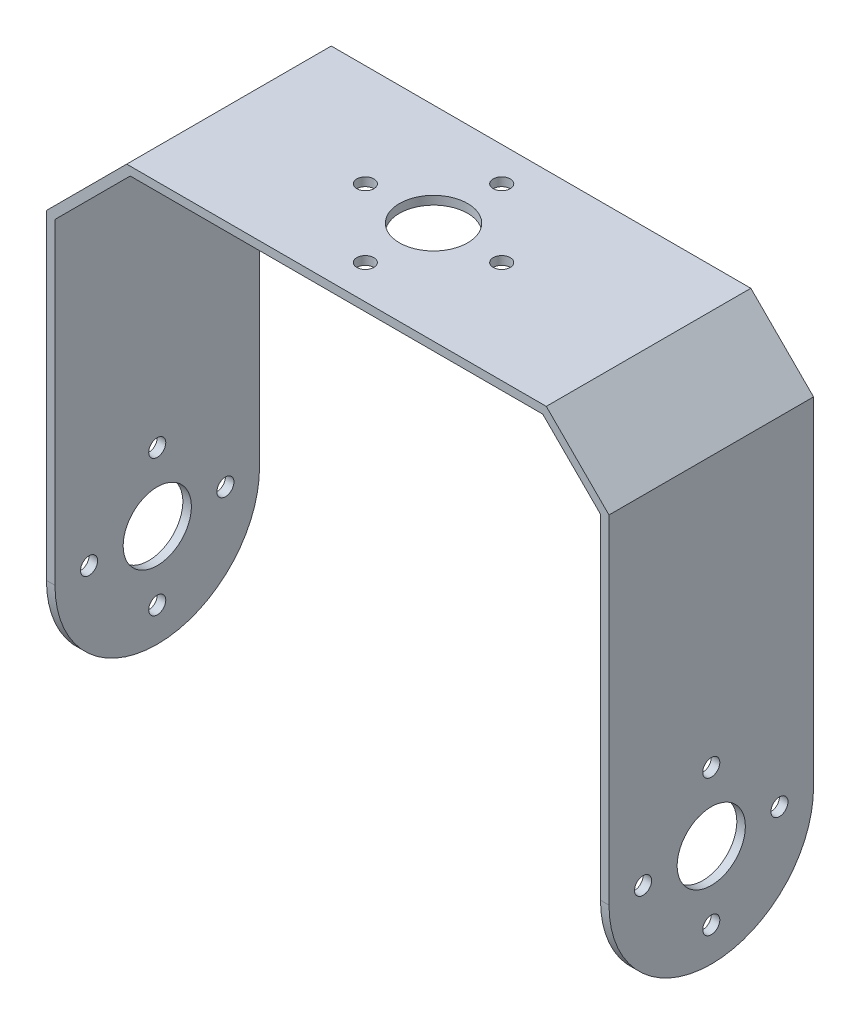
ISO-10303-21;
HEADER;
FILE_DESCRIPTION(('STEP AP214'),'2;1');
FILE_NAME('part.step','',(''),(''),'','','');
FILE_SCHEMA(('AUTOMOTIVE_DESIGN { 1 0 10303 214 1 1 1 1 }'));
ENDSEC;
DATA;
#1=APPLICATION_CONTEXT('core data for automotive mechanical design processes');
#2=APPLICATION_PROTOCOL_DEFINITION('international standard','automotive_design',2000,#1);
#3=PRODUCT_CONTEXT('',#1,'mechanical');
#4=PRODUCT('Part','Part','',(#3));
#5=PRODUCT_RELATED_PRODUCT_CATEGORY('part','',(#4));
#6=PRODUCT_DEFINITION_FORMATION('','',#4);
#7=PRODUCT_DEFINITION_CONTEXT('part definition',#1,'design');
#8=PRODUCT_DEFINITION('design','',#6,#7);
#9=PRODUCT_DEFINITION_SHAPE('','',#8);
#10=(LENGTH_UNIT() NAMED_UNIT(*) SI_UNIT(.MILLI.,.METRE.));
#11=(NAMED_UNIT(*) PLANE_ANGLE_UNIT() SI_UNIT($,.RADIAN.));
#12=(NAMED_UNIT(*) SI_UNIT($,.STERADIAN.) SOLID_ANGLE_UNIT());
#13=UNCERTAINTY_MEASURE_WITH_UNIT(LENGTH_MEASURE(1.E-05),#10,'distance_accuracy_value','');
#14=(GEOMETRIC_REPRESENTATION_CONTEXT(3) GLOBAL_UNCERTAINTY_ASSIGNED_CONTEXT((#13)) GLOBAL_UNIT_ASSIGNED_CONTEXT((#10,
#11,#12)) REPRESENTATION_CONTEXT('',''));
#15=CARTESIAN_POINT('',(0.,0.,0.));
#16=DIRECTION('',(0.,0.,1.));
#17=DIRECTION('',(1.,0.,0.));
#18=AXIS2_PLACEMENT_3D('',#15,#16,#17);
#19=CARTESIAN_POINT('',(18.7066126884337,0.24678934952288,24.));
#20=DIRECTION('',(0.707106781186547,0.707106781186548,0.));
#21=DIRECTION('',(-0.707106781186548,0.707106781186547,0.));
#22=AXIS2_PLACEMENT_3D('',#19,#20,#21);
#23=PLANE('',#22);
#24=DIRECTION('',(0.707106781186548,-0.707106781186547,0.));
#25=VECTOR('',#24,1.);
#26=CARTESIAN_POINT('',(18.7066126884337,0.24678934952288,0.));
#27=LINE('',#26,#25);
#28=CARTESIAN_POINT('',(11.9350398131801,7.01836222477647,0.));
#29=VERTEX_POINT('',#28);
#30=CARTESIAN_POINT('',(18.7066126884337,0.24678934952288,0.));
#31=VERTEX_POINT('',#30);
#32=EDGE_CURVE('E168',#29,#31,#27,.T.);
#33=ORIENTED_EDGE('',*,*,#32,.T.);
#34=DIRECTION('',(0.,0.,-1.));
#35=VECTOR('',#34,1.);
#36=CARTESIAN_POINT('',(18.7066126884337,0.24678934952288,24.));
#37=LINE('',#36,#35);
#38=CARTESIAN_POINT('',(18.7066126884337,0.24678934952288,24.));
#39=VERTEX_POINT('',#38);
#40=EDGE_CURVE('E146',#39,#31,#37,.T.);
#41=ORIENTED_EDGE('',*,*,#40,.F.);
#42=DIRECTION('',(0.707106781186548,-0.707106781186547,0.));
#43=VECTOR('',#42,1.);
#44=CARTESIAN_POINT('',(18.7066126884337,0.24678934952288,24.));
#45=LINE('',#44,#43);
#46=CARTESIAN_POINT('',(11.9350398131801,7.01836222477647,24.));
#47=VERTEX_POINT('',#46);
#48=EDGE_CURVE('E155',#47,#39,#45,.T.);
#49=ORIENTED_EDGE('',*,*,#48,.F.);
#50=DIRECTION('',(0.,0.,-1.));
#51=VECTOR('',#50,1.);
#52=CARTESIAN_POINT('',(11.9350398131801,7.01836222477647,24.));
#53=LINE('',#52,#51);
#54=EDGE_CURVE('E253',#47,#29,#53,.T.);
#55=ORIENTED_EDGE('',*,*,#54,.T.);
#56=EDGE_LOOP('',(#33,#41,#49,#55));
#57=FACE_BOUND('',#56,.T.);
#58=ADVANCED_FACE('F38',(#57),#23,.F.);
#59=CARTESIAN_POINT('',(18.7066126884337,0.24678934952288,24.));
#60=DIRECTION('',(1.,0.,0.));
#61=DIRECTION('',(0.,0.,-1.));
#62=AXIS2_PLACEMENT_3D('',#59,#60,#61);
#63=PLANE('',#62);
#64=CARTESIAN_POINT('',(18.7066126884337,-46.9816377752235,12.));
#65=DIRECTION('',(1.,0.,0.));
#66=DIRECTION('',(0.,0.,-1.));
#67=AXIS2_PLACEMENT_3D('',#64,#65,#66);
#68=CIRCLE('',#67,0.999999999999998);
#69=CARTESIAN_POINT('',(18.7066126884337,-46.9816377752235,11.));
#70=VERTEX_POINT('',#69);
#71=EDGE_CURVE('E392',#70,#70,#68,.T.);
#72=ORIENTED_EDGE('',*,*,#71,.T.);
#73=EDGE_LOOP('',(#72));
#74=FACE_BOUND('',#73,.T.);
#75=CARTESIAN_POINT('',(18.7066126884337,-38.9816377752235,12.));
#76=DIRECTION('',(1.,0.,0.));
#77=DIRECTION('',(0.,0.,-1.));
#78=AXIS2_PLACEMENT_3D('',#75,#76,#77);
#79=CIRCLE('',#78,4.);
#80=CARTESIAN_POINT('',(18.7066126884337,-38.9816377752235,8.));
#81=VERTEX_POINT('',#80);
#82=EDGE_CURVE('E384',#81,#81,#79,.T.);
#83=ORIENTED_EDGE('',*,*,#82,.T.);
#84=EDGE_LOOP('',(#83));
#85=FACE_BOUND('',#84,.T.);
#86=CARTESIAN_POINT('',(18.7066126884337,-38.9816377752235,20.));
#87=DIRECTION('',(1.,0.,0.));
#88=DIRECTION('',(0.,0.,-1.));
#89=AXIS2_PLACEMENT_3D('',#86,#87,#88);
#90=CIRCLE('',#89,1.);
#91=CARTESIAN_POINT('',(18.7066126884337,-38.9816377752235,19.));
#92=VERTEX_POINT('',#91);
#93=EDGE_CURVE('E376',#92,#92,#90,.T.);
#94=ORIENTED_EDGE('',*,*,#93,.T.);
#95=EDGE_LOOP('',(#94));
#96=FACE_BOUND('',#95,.T.);
#97=CARTESIAN_POINT('',(18.7066126884337,-30.9816377752235,11.9999999999999));
#98=DIRECTION('',(1.,0.,0.));
#99=DIRECTION('',(0.,0.,-1.));
#100=AXIS2_PLACEMENT_3D('',#97,#98,#99);
#101=CIRCLE('',#100,1.);
#102=CARTESIAN_POINT('',(18.7066126884337,-30.9816377752235,10.9999999999999));
#103=VERTEX_POINT('',#102);
#104=EDGE_CURVE('E368',#103,#103,#101,.T.);
#105=ORIENTED_EDGE('',*,*,#104,.T.);
#106=EDGE_LOOP('',(#105));
#107=FACE_BOUND('',#106,.T.);
#108=CARTESIAN_POINT('',(18.7066126884337,-38.9816377752235,4.));
#109=DIRECTION('',(1.,0.,0.));
#110=DIRECTION('',(0.,0.,-1.));
#111=AXIS2_PLACEMENT_3D('',#108,#109,#110);
#112=CIRCLE('',#111,1.);
#113=CARTESIAN_POINT('',(18.7066126884337,-38.9816377752235,3.));
#114=VERTEX_POINT('',#113);
#115=EDGE_CURVE('E356',#114,#114,#112,.T.);
#116=ORIENTED_EDGE('',*,*,#115,.T.);
#117=EDGE_LOOP('',(#116));
#118=FACE_BOUND('',#117,.T.);
#119=CARTESIAN_POINT('',(18.7066126884337,-38.9816377752235,12.));
#120=DIRECTION('',(1.,0.,0.));
#121=DIRECTION('',(0.,0.,-1.));
#122=AXIS2_PLACEMENT_3D('',#119,#120,#121);
#123=CIRCLE('',#122,12.);
#124=CARTESIAN_POINT('',(18.7066126884337,-38.9816377752235,0.));
#125=VERTEX_POINT('',#124);
#126=CARTESIAN_POINT('',(18.7066126884337,-50.9816377752235,12.));
#127=VERTEX_POINT('',#126);
#128=EDGE_CURVE('E192',#125,#127,#123,.F.);
#129=ORIENTED_EDGE('',*,*,#128,.T.);
#130=CARTESIAN_POINT('',(18.7066126884337,-38.9816377752235,12.));
#131=DIRECTION('',(1.,0.,0.));
#132=DIRECTION('',(0.,0.,-1.));
#133=AXIS2_PLACEMENT_3D('',#130,#131,#132);
#134=CIRCLE('',#133,12.);
#135=CARTESIAN_POINT('',(18.7066126884337,-38.9816377752235,24.));
#136=VERTEX_POINT('',#135);
#137=EDGE_CURVE('E149',#127,#136,#134,.F.);
#138=ORIENTED_EDGE('',*,*,#137,.T.);
#139=DIRECTION('',(0.,-1.,0.));
#140=VECTOR('',#139,1.);
#141=CARTESIAN_POINT('',(18.7066126884337,0.24678934952288,24.));
#142=LINE('',#141,#140);
#143=EDGE_CURVE('E141',#39,#136,#142,.T.);
#144=ORIENTED_EDGE('',*,*,#143,.F.);
#145=ORIENTED_EDGE('',*,*,#40,.T.);
#146=DIRECTION('',(0.,-1.,0.));
#147=VECTOR('',#146,1.);
#148=CARTESIAN_POINT('',(18.7066126884337,0.24678934952288,0.));
#149=LINE('',#148,#147);
#150=EDGE_CURVE('E294',#31,#125,#149,.T.);
#151=ORIENTED_EDGE('',*,*,#150,.T.);
#152=EDGE_LOOP('',(#129,#138,#144,#145,#151));
#153=FACE_BOUND('',#152,.T.);
#154=ADVANCED_FACE('F143',(#74,#85,#96,#107,#118,#153),#63,.F.);
#155=CARTESIAN_POINT('',(19.7066126884337,0.661002911895975,24.));
#156=DIRECTION('',(-1.,0.,0.));
#157=DIRECTION('',(0.,0.,1.));
#158=AXIS2_PLACEMENT_3D('',#155,#156,#157);
#159=PLANE('',#158);
#160=CARTESIAN_POINT('',(19.7066126884337,-46.9816377752235,12.));
#161=DIRECTION('',(1.,0.,0.));
#162=DIRECTION('',(0.,0.,-1.));
#163=AXIS2_PLACEMENT_3D('',#160,#161,#162);
#164=CIRCLE('',#163,0.999999999999998);
#165=CARTESIAN_POINT('',(19.7066126884337,-46.9816377752235,11.));
#166=VERTEX_POINT('',#165);
#167=EDGE_CURVE('E388',#166,#166,#164,.T.);
#168=ORIENTED_EDGE('',*,*,#167,.F.);
#169=EDGE_LOOP('',(#168));
#170=FACE_BOUND('',#169,.T.);
#171=CARTESIAN_POINT('',(19.7066126884337,-38.9816377752235,12.));
#172=DIRECTION('',(1.,0.,0.));
#173=DIRECTION('',(0.,0.,-1.));
#174=AXIS2_PLACEMENT_3D('',#171,#172,#173);
#175=CIRCLE('',#174,4.);
#176=CARTESIAN_POINT('',(19.7066126884337,-38.9816377752235,8.));
#177=VERTEX_POINT('',#176);
#178=EDGE_CURVE('E380',#177,#177,#175,.T.);
#179=ORIENTED_EDGE('',*,*,#178,.F.);
#180=EDGE_LOOP('',(#179));
#181=FACE_BOUND('',#180,.T.);
#182=CARTESIAN_POINT('',(19.7066126884337,-38.9816377752235,20.));
#183=DIRECTION('',(1.,0.,0.));
#184=DIRECTION('',(0.,0.,-1.));
#185=AXIS2_PLACEMENT_3D('',#182,#183,#184);
#186=CIRCLE('',#185,1.);
#187=CARTESIAN_POINT('',(19.7066126884337,-38.9816377752235,19.));
#188=VERTEX_POINT('',#187);
#189=EDGE_CURVE('E372',#188,#188,#186,.T.);
#190=ORIENTED_EDGE('',*,*,#189,.F.);
#191=EDGE_LOOP('',(#190));
#192=FACE_BOUND('',#191,.T.);
#193=CARTESIAN_POINT('',(19.7066126884337,-30.9816377752235,11.9999999999999));
#194=DIRECTION('',(1.,0.,0.));
#195=DIRECTION('',(0.,0.,-1.));
#196=AXIS2_PLACEMENT_3D('',#193,#194,#195);
#197=CIRCLE('',#196,1.);
#198=CARTESIAN_POINT('',(19.7066126884337,-30.9816377752235,10.9999999999999));
#199=VERTEX_POINT('',#198);
#200=EDGE_CURVE('E364',#199,#199,#197,.T.);
#201=ORIENTED_EDGE('',*,*,#200,.F.);
#202=EDGE_LOOP('',(#201));
#203=FACE_BOUND('',#202,.T.);
#204=CARTESIAN_POINT('',(19.7066126884337,-38.9816377752235,4.));
#205=DIRECTION('',(1.,0.,0.));
#206=DIRECTION('',(0.,0.,-1.));
#207=AXIS2_PLACEMENT_3D('',#204,#205,#206);
#208=CIRCLE('',#207,1.);
#209=CARTESIAN_POINT('',(19.7066126884337,-38.9816377752235,3.));
#210=VERTEX_POINT('',#209);
#211=EDGE_CURVE('E360',#210,#210,#208,.T.);
#212=ORIENTED_EDGE('',*,*,#211,.F.);
#213=EDGE_LOOP('',(#212));
#214=FACE_BOUND('',#213,.T.);
#215=DIRECTION('',(0.,1.,0.));
#216=VECTOR('',#215,1.);
#217=CARTESIAN_POINT('',(19.7066126884337,0.661002911895975,24.));
#218=LINE('',#217,#216);
#219=CARTESIAN_POINT('',(19.7066126884337,-38.9816377752235,24.));
#220=VERTEX_POINT('',#219);
#221=CARTESIAN_POINT('',(19.7066126884337,0.661002911895975,24.));
#222=VERTEX_POINT('',#221);
#223=EDGE_CURVE('E154',#220,#222,#218,.T.);
#224=ORIENTED_EDGE('',*,*,#223,.F.);
#225=CARTESIAN_POINT('',(19.7066126884337,-38.9816377752235,12.));
#226=DIRECTION('',(-1.,0.,0.));
#227=DIRECTION('',(0.,0.,1.));
#228=AXIS2_PLACEMENT_3D('',#225,#226,#227);
#229=CIRCLE('',#228,12.);
#230=CARTESIAN_POINT('',(19.7066126884337,-50.9816377752235,12.));
#231=VERTEX_POINT('',#230);
#232=EDGE_CURVE('E189',#220,#231,#229,.F.);
#233=ORIENTED_EDGE('',*,*,#232,.T.);
#234=CARTESIAN_POINT('',(19.7066126884337,-38.9816377752235,12.));
#235=DIRECTION('',(-1.,0.,0.));
#236=DIRECTION('',(0.,0.,1.));
#237=AXIS2_PLACEMENT_3D('',#234,#235,#236);
#238=CIRCLE('',#237,12.);
#239=CARTESIAN_POINT('',(19.7066126884337,-38.9816377752235,0.));
#240=VERTEX_POINT('',#239);
#241=EDGE_CURVE('E186',#231,#240,#238,.F.);
#242=ORIENTED_EDGE('',*,*,#241,.T.);
#243=DIRECTION('',(0.,1.,0.));
#244=VECTOR('',#243,1.);
#245=CARTESIAN_POINT('',(19.7066126884337,0.661002911895975,0.));
#246=LINE('',#245,#244);
#247=CARTESIAN_POINT('',(19.7066126884337,0.661002911895975,0.));
#248=VERTEX_POINT('',#247);
#249=EDGE_CURVE('E289',#240,#248,#246,.T.);
#250=ORIENTED_EDGE('',*,*,#249,.T.);
#251=DIRECTION('',(0.,0.,-1.));
#252=VECTOR('',#251,1.);
#253=CARTESIAN_POINT('',(19.7066126884337,0.661002911895975,24.));
#254=LINE('',#253,#252);
#255=EDGE_CURVE('E171',#222,#248,#254,.T.);
#256=ORIENTED_EDGE('',*,*,#255,.F.);
#257=EDGE_LOOP('',(#224,#233,#242,#250,#256));
#258=FACE_BOUND('',#257,.T.);
#259=ADVANCED_FACE('F471',(#170,#181,#192,#203,#214,#258),#159,.F.);
#260=CARTESIAN_POINT('',(19.7066126884337,0.661002911895975,24.));
#261=DIRECTION('',(-0.707106781186548,-0.707106781186547,0.));
#262=DIRECTION('',(0.707106781186547,-0.707106781186548,0.));
#263=AXIS2_PLACEMENT_3D('',#260,#261,#262);
#264=PLANE('',#263);
#265=DIRECTION('',(-0.707106781186547,0.707106781186548,0.));
#266=VECTOR('',#265,1.);
#267=CARTESIAN_POINT('',(19.7066126884337,0.661002911895975,0.));
#268=LINE('',#267,#266);
#269=CARTESIAN_POINT('',(12.3492533755532,8.01836222477647,0.));
#270=VERTEX_POINT('',#269);
#271=EDGE_CURVE('E286',#248,#270,#268,.T.);
#272=ORIENTED_EDGE('',*,*,#271,.T.);
#273=DIRECTION('',(0.,0.,-1.));
#274=VECTOR('',#273,1.);
#275=CARTESIAN_POINT('',(12.3492533755532,8.01836222477647,24.));
#276=LINE('',#275,#274);
#277=CARTESIAN_POINT('',(12.3492533755532,8.01836222477647,24.));
#278=VERTEX_POINT('',#277);
#279=EDGE_CURVE('E180',#278,#270,#276,.T.);
#280=ORIENTED_EDGE('',*,*,#279,.F.);
#281=DIRECTION('',(-0.707106781186547,0.707106781186548,0.));
#282=VECTOR('',#281,1.);
#283=CARTESIAN_POINT('',(19.7066126884337,0.661002911895975,24.));
#284=LINE('',#283,#282);
#285=EDGE_CURVE('E316',#222,#278,#284,.T.);
#286=ORIENTED_EDGE('',*,*,#285,.F.);
#287=ORIENTED_EDGE('',*,*,#255,.T.);
#288=EDGE_LOOP('',(#272,#280,#286,#287));
#289=FACE_BOUND('',#288,.T.);
#290=ADVANCED_FACE('F439',(#289),#264,.F.);
#291=CARTESIAN_POINT('',(-36.879173749193,8.01836222477648,24.));
#292=DIRECTION('',(0.,-1.,0.));
#293=DIRECTION('',(1.,0.,0.));
#294=AXIS2_PLACEMENT_3D('',#291,#292,#293);
#295=PLANE('',#294);
#296=CARTESIAN_POINT('',(-12.879173749193,8.01836222477649,12.));
#297=DIRECTION('',(0.,1.,0.));
#298=DIRECTION('',(-1.,0.,0.));
#299=AXIS2_PLACEMENT_3D('',#296,#297,#298);
#300=CIRCLE('',#299,4.);
#301=CARTESIAN_POINT('',(-16.879173749193,8.0183622247765,12.));
#302=VERTEX_POINT('',#301);
#303=EDGE_CURVE('E218',#302,#302,#300,.T.);
#304=ORIENTED_EDGE('',*,*,#303,.F.);
#305=EDGE_LOOP('',(#304));
#306=FACE_BOUND('',#305,.T.);
#307=CARTESIAN_POINT('',(-4.879173749193,8.01836222477648,12.0000000000001));
#308=DIRECTION('',(0.,1.,0.));
#309=DIRECTION('',(-1.,0.,0.));
#310=AXIS2_PLACEMENT_3D('',#307,#308,#309);
#311=CIRCLE('',#310,1.);
#312=CARTESIAN_POINT('',(-5.879173749193,8.01836222477648,12.0000000000001));
#313=VERTEX_POINT('',#312);
#314=EDGE_CURVE('E419',#313,#313,#311,.T.);
#315=ORIENTED_EDGE('',*,*,#314,.F.);
#316=EDGE_LOOP('',(#315));
#317=FACE_BOUND('',#316,.T.);
#318=CARTESIAN_POINT('',(-20.879173749193,8.0183622247765,12.));
#319=DIRECTION('',(0.,1.,0.));
#320=DIRECTION('',(-1.,0.,0.));
#321=AXIS2_PLACEMENT_3D('',#318,#319,#320);
#322=CIRCLE('',#321,1.);
#323=CARTESIAN_POINT('',(-21.879173749193,8.0183622247765,12.));
#324=VERTEX_POINT('',#323);
#325=EDGE_CURVE('E412',#324,#324,#322,.T.);
#326=ORIENTED_EDGE('',*,*,#325,.F.);
#327=EDGE_LOOP('',(#326));
#328=FACE_BOUND('',#327,.T.);
#329=CARTESIAN_POINT('',(-12.879173749193,8.01836222477649,20.));
#330=DIRECTION('',(0.,1.,0.));
#331=DIRECTION('',(-1.,0.,0.));
#332=AXIS2_PLACEMENT_3D('',#329,#330,#331);
#333=CIRCLE('',#332,1.);
#334=CARTESIAN_POINT('',(-13.879173749193,8.01836222477649,20.));
#335=VERTEX_POINT('',#334);
#336=EDGE_CURVE('E404',#335,#335,#333,.T.);
#337=ORIENTED_EDGE('',*,*,#336,.F.);
#338=EDGE_LOOP('',(#337));
#339=FACE_BOUND('',#338,.T.);
#340=CARTESIAN_POINT('',(-12.879173749193,8.01836222477649,4.));
#341=DIRECTION('',(0.,1.,0.));
#342=DIRECTION('',(-1.,0.,0.));
#343=AXIS2_PLACEMENT_3D('',#340,#341,#342);
#344=CIRCLE('',#343,1.);
#345=CARTESIAN_POINT('',(-13.879173749193,8.01836222477649,4.));
#346=VERTEX_POINT('',#345);
#347=EDGE_CURVE('E400',#346,#346,#344,.T.);
#348=ORIENTED_EDGE('',*,*,#347,.F.);
#349=EDGE_LOOP('',(#348));
#350=FACE_BOUND('',#349,.T.);
#351=DIRECTION('',(-1.,0.,0.));
#352=VECTOR('',#351,1.);
#353=CARTESIAN_POINT('',(-36.879173749193,8.01836222477648,0.));
#354=LINE('',#353,#352);
#355=CARTESIAN_POINT('',(-36.879173749193,8.01836222477648,0.));
#356=VERTEX_POINT('',#355);
#357=EDGE_CURVE('E280',#270,#356,#354,.T.);
#358=ORIENTED_EDGE('',*,*,#357,.T.);
#359=DIRECTION('',(0.,0.,-1.));
#360=VECTOR('',#359,1.);
#361=CARTESIAN_POINT('',(-36.879173749193,8.01836222477648,24.));
#362=LINE('',#361,#360);
#363=CARTESIAN_POINT('',(-36.879173749193,8.01836222477648,24.));
#364=VERTEX_POINT('',#363);
#365=EDGE_CURVE('E267',#364,#356,#362,.T.);
#366=ORIENTED_EDGE('',*,*,#365,.F.);
#367=DIRECTION('',(-1.,0.,0.));
#368=VECTOR('',#367,1.);
#369=CARTESIAN_POINT('',(-36.879173749193,8.01836222477648,24.));
#370=LINE('',#369,#368);
#371=EDGE_CURVE('E281',#278,#364,#370,.T.);
#372=ORIENTED_EDGE('',*,*,#371,.F.);
#373=ORIENTED_EDGE('',*,*,#279,.T.);
#374=EDGE_LOOP('',(#358,#366,#372,#373));
#375=FACE_BOUND('',#374,.T.);
#376=ADVANCED_FACE('F278',(#306,#317,#328,#339,#350,#375),#295,.F.);
#377=CARTESIAN_POINT('',(-46.2933873115661,-1.39585133759661,24.));
#378=DIRECTION('',(0.707106781186548,-0.707106781186547,0.));
#379=DIRECTION('',(0.707106781186547,0.707106781186548,0.));
#380=AXIS2_PLACEMENT_3D('',#377,#378,#379);
#381=PLANE('',#380);
#382=DIRECTION('',(-0.707106781186547,-0.707106781186548,0.));
#383=VECTOR('',#382,1.);
#384=CARTESIAN_POINT('',(-46.2933873115661,-1.39585133759661,0.));
#385=LINE('',#384,#383);
#386=CARTESIAN_POINT('',(-46.2933873115661,-1.39585133759661,0.));
#387=VERTEX_POINT('',#386);
#388=EDGE_CURVE('E247',#356,#387,#385,.T.);
#389=ORIENTED_EDGE('',*,*,#388,.T.);
#390=DIRECTION('',(0.,0.,-1.));
#391=VECTOR('',#390,1.);
#392=CARTESIAN_POINT('',(-46.2933873115661,-1.39585133759661,24.));
#393=LINE('',#392,#391);
#394=CARTESIAN_POINT('',(-46.2933873115661,-1.39585133759661,24.));
#395=VERTEX_POINT('',#394);
#396=EDGE_CURVE('E263',#395,#387,#393,.T.);
#397=ORIENTED_EDGE('',*,*,#396,.F.);
#398=DIRECTION('',(-0.707106781186547,-0.707106781186548,0.));
#399=VECTOR('',#398,1.);
#400=CARTESIAN_POINT('',(-46.2933873115661,-1.39585133759661,24.));
#401=LINE('',#400,#399);
#402=EDGE_CURVE('E311',#364,#395,#401,.T.);
#403=ORIENTED_EDGE('',*,*,#402,.F.);
#404=ORIENTED_EDGE('',*,*,#365,.T.);
#405=EDGE_LOOP('',(#389,#397,#403,#404));
#406=FACE_BOUND('',#405,.T.);
#407=ADVANCED_FACE('F438',(#406),#381,.F.);
#408=CARTESIAN_POINT('',(-46.2933873115661,-1.39585133759661,24.));
#409=DIRECTION('',(1.,0.,0.));
#410=DIRECTION('',(0.,0.,-1.));
#411=AXIS2_PLACEMENT_3D('',#408,#409,#410);
#412=PLANE('',#411);
#413=CARTESIAN_POINT('',(-46.2933873115661,-38.9816377752235,20.));
#414=DIRECTION('',(-1.,0.,0.));
#415=DIRECTION('',(0.,0.,1.));
#416=AXIS2_PLACEMENT_3D('',#413,#414,#415);
#417=CIRCLE('',#416,1.);
#418=CARTESIAN_POINT('',(-46.2933873115661,-38.9816377752235,21.));
#419=VERTEX_POINT('',#418);
#420=EDGE_CURVE('E348',#419,#419,#417,.T.);
#421=ORIENTED_EDGE('',*,*,#420,.F.);
#422=EDGE_LOOP('',(#421));
#423=FACE_BOUND('',#422,.T.);
#424=CARTESIAN_POINT('',(-46.2933873115661,-38.9816377752235,4.));
#425=DIRECTION('',(-1.,0.,0.));
#426=DIRECTION('',(0.,0.,1.));
#427=AXIS2_PLACEMENT_3D('',#424,#425,#426);
#428=CIRCLE('',#427,1.);
#429=CARTESIAN_POINT('',(-46.2933873115661,-38.9816377752235,5.));
#430=VERTEX_POINT('',#429);
#431=EDGE_CURVE('E340',#430,#430,#428,.T.);
#432=ORIENTED_EDGE('',*,*,#431,.F.);
#433=EDGE_LOOP('',(#432));
#434=FACE_BOUND('',#433,.T.);
#435=CARTESIAN_POINT('',(-46.2933873115661,-46.9816377752235,12.));
#436=DIRECTION('',(-1.,0.,0.));
#437=DIRECTION('',(0.,0.,1.));
#438=AXIS2_PLACEMENT_3D('',#435,#436,#437);
#439=CIRCLE('',#438,1.);
#440=CARTESIAN_POINT('',(-46.2933873115661,-46.9816377752235,13.));
#441=VERTEX_POINT('',#440);
#442=EDGE_CURVE('E332',#441,#441,#439,.T.);
#443=ORIENTED_EDGE('',*,*,#442,.F.);
#444=EDGE_LOOP('',(#443));
#445=FACE_BOUND('',#444,.T.);
#446=CARTESIAN_POINT('',(-46.2933873115661,-30.9816377752235,12.0000000000001));
#447=DIRECTION('',(-1.,0.,0.));
#448=DIRECTION('',(0.,0.,1.));
#449=AXIS2_PLACEMENT_3D('',#446,#447,#448);
#450=CIRCLE('',#449,1.);
#451=CARTESIAN_POINT('',(-46.2933873115661,-30.9816377752235,13.0000000000001));
#452=VERTEX_POINT('',#451);
#453=EDGE_CURVE('E324',#452,#452,#450,.T.);
#454=ORIENTED_EDGE('',*,*,#453,.F.);
#455=EDGE_LOOP('',(#454));
#456=FACE_BOUND('',#455,.T.);
#457=CARTESIAN_POINT('',(-46.2933873115661,-38.9816377752235,12.));
#458=DIRECTION('',(-1.,0.,0.));
#459=DIRECTION('',(0.,0.,1.));
#460=AXIS2_PLACEMENT_3D('',#457,#458,#459);
#461=CIRCLE('',#460,4.);
#462=CARTESIAN_POINT('',(-46.2933873115661,-38.9816377752235,16.));
#463=VERTEX_POINT('',#462);
#464=EDGE_CURVE('E320',#463,#463,#461,.T.);
#465=ORIENTED_EDGE('',*,*,#464,.F.);
#466=EDGE_LOOP('',(#465));
#467=FACE_BOUND('',#466,.T.);
#468=CARTESIAN_POINT('',(-46.2933873115661,-38.9816377752235,12.));
#469=DIRECTION('',(1.,0.,0.));
#470=DIRECTION('',(0.,0.,-1.));
#471=AXIS2_PLACEMENT_3D('',#468,#469,#470);
#472=CIRCLE('',#471,12.);
#473=CARTESIAN_POINT('',(-46.2933873115661,-38.9816377752235,0.));
#474=VERTEX_POINT('',#473);
#475=CARTESIAN_POINT('',(-46.2933873115661,-50.9816377752235,12.));
#476=VERTEX_POINT('',#475);
#477=EDGE_CURVE('E48',#474,#476,#472,.F.);
#478=ORIENTED_EDGE('',*,*,#477,.T.);
#479=CARTESIAN_POINT('',(-46.2933873115661,-38.9816377752235,12.));
#480=DIRECTION('',(1.,0.,0.));
#481=DIRECTION('',(0.,0.,-1.));
#482=AXIS2_PLACEMENT_3D('',#479,#480,#481);
#483=CIRCLE('',#482,12.);
#484=CARTESIAN_POINT('',(-46.2933873115661,-38.9816377752235,24.));
#485=VERTEX_POINT('',#484);
#486=EDGE_CURVE('E11',#476,#485,#483,.F.);
#487=ORIENTED_EDGE('',*,*,#486,.T.);
#488=DIRECTION('',(0.,-1.,0.));
#489=VECTOR('',#488,1.);
#490=CARTESIAN_POINT('',(-46.2933873115661,-1.39585133759661,24.));
#491=LINE('',#490,#489);
#492=EDGE_CURVE('E308',#395,#485,#491,.T.);
#493=ORIENTED_EDGE('',*,*,#492,.F.);
#494=ORIENTED_EDGE('',*,*,#396,.T.);
#495=DIRECTION('',(0.,-1.,0.));
#496=VECTOR('',#495,1.);
#497=CARTESIAN_POINT('',(-46.2933873115661,-1.39585133759661,0.));
#498=LINE('',#497,#496);
#499=EDGE_CURVE('E240',#387,#474,#498,.T.);
#500=ORIENTED_EDGE('',*,*,#499,.T.);
#501=EDGE_LOOP('',(#478,#487,#493,#494,#500));
#502=FACE_BOUND('',#501,.T.);
#503=ADVANCED_FACE('F645',(#423,#434,#445,#456,#467,#502),#412,.F.);
#504=CARTESIAN_POINT('',(-45.2933873115661,-1.8100648999697,24.));
#505=DIRECTION('',(-1.,0.,0.));
#506=DIRECTION('',(0.,0.,1.));
#507=AXIS2_PLACEMENT_3D('',#504,#505,#506);
#508=PLANE('',#507);
#509=CARTESIAN_POINT('',(-45.2933873115661,-38.9816377752235,20.));
#510=DIRECTION('',(-1.,0.,0.));
#511=DIRECTION('',(0.,0.,1.));
#512=AXIS2_PLACEMENT_3D('',#509,#510,#511);
#513=CIRCLE('',#512,1.);
#514=CARTESIAN_POINT('',(-45.2933873115661,-38.9816377752235,21.));
#515=VERTEX_POINT('',#514);
#516=EDGE_CURVE('E352',#515,#515,#513,.T.);
#517=ORIENTED_EDGE('',*,*,#516,.T.);
#518=EDGE_LOOP('',(#517));
#519=FACE_BOUND('',#518,.T.);
#520=CARTESIAN_POINT('',(-45.2933873115661,-38.9816377752235,4.));
#521=DIRECTION('',(-1.,0.,0.));
#522=DIRECTION('',(0.,0.,1.));
#523=AXIS2_PLACEMENT_3D('',#520,#521,#522);
#524=CIRCLE('',#523,1.);
#525=CARTESIAN_POINT('',(-45.2933873115661,-38.9816377752235,5.));
#526=VERTEX_POINT('',#525);
#527=EDGE_CURVE('E344',#526,#526,#524,.T.);
#528=ORIENTED_EDGE('',*,*,#527,.T.);
#529=EDGE_LOOP('',(#528));
#530=FACE_BOUND('',#529,.T.);
#531=CARTESIAN_POINT('',(-45.2933873115661,-46.9816377752235,12.));
#532=DIRECTION('',(-1.,0.,0.));
#533=DIRECTION('',(0.,0.,1.));
#534=AXIS2_PLACEMENT_3D('',#531,#532,#533);
#535=CIRCLE('',#534,1.);
#536=CARTESIAN_POINT('',(-45.2933873115661,-46.9816377752235,13.));
#537=VERTEX_POINT('',#536);
#538=EDGE_CURVE('E336',#537,#537,#535,.T.);
#539=ORIENTED_EDGE('',*,*,#538,.T.);
#540=EDGE_LOOP('',(#539));
#541=FACE_BOUND('',#540,.T.);
#542=CARTESIAN_POINT('',(-45.2933873115661,-30.9816377752235,12.0000000000001));
#543=DIRECTION('',(-1.,0.,0.));
#544=DIRECTION('',(0.,0.,1.));
#545=AXIS2_PLACEMENT_3D('',#542,#543,#544);
#546=CIRCLE('',#545,1.);
#547=CARTESIAN_POINT('',(-45.2933873115661,-30.9816377752235,13.0000000000001));
#548=VERTEX_POINT('',#547);
#549=EDGE_CURVE('E328',#548,#548,#546,.T.);
#550=ORIENTED_EDGE('',*,*,#549,.T.);
#551=EDGE_LOOP('',(#550));
#552=FACE_BOUND('',#551,.T.);
#553=CARTESIAN_POINT('',(-45.2933873115661,-38.9816377752235,12.));
#554=DIRECTION('',(-1.,0.,0.));
#555=DIRECTION('',(0.,0.,1.));
#556=AXIS2_PLACEMENT_3D('',#553,#554,#555);
#557=CIRCLE('',#556,4.);
#558=CARTESIAN_POINT('',(-45.2933873115661,-38.9816377752235,16.));
#559=VERTEX_POINT('',#558);
#560=EDGE_CURVE('E299',#559,#559,#557,.T.);
#561=ORIENTED_EDGE('',*,*,#560,.T.);
#562=EDGE_LOOP('',(#561));
#563=FACE_BOUND('',#562,.T.);
#564=DIRECTION('',(0.,1.,0.));
#565=VECTOR('',#564,1.);
#566=CARTESIAN_POINT('',(-45.2933873115661,-1.8100648999697,24.));
#567=LINE('',#566,#565);
#568=CARTESIAN_POINT('',(-45.2933873115661,-38.9816377752235,24.));
#569=VERTEX_POINT('',#568);
#570=CARTESIAN_POINT('',(-45.2933873115661,-1.8100648999697,24.));
#571=VERTEX_POINT('',#570);
#572=EDGE_CURVE('E305',#569,#571,#567,.T.);
#573=ORIENTED_EDGE('',*,*,#572,.F.);
#574=CARTESIAN_POINT('',(-45.2933873115661,-38.9816377752235,12.));
#575=DIRECTION('',(-1.,0.,0.));
#576=DIRECTION('',(0.,0.,1.));
#577=AXIS2_PLACEMENT_3D('',#574,#575,#576);
#578=CIRCLE('',#577,12.);
#579=CARTESIAN_POINT('',(-45.2933873115661,-50.9816377752235,12.));
#580=VERTEX_POINT('',#579);
#581=EDGE_CURVE('E62',#569,#580,#578,.F.);
#582=ORIENTED_EDGE('',*,*,#581,.T.);
#583=CARTESIAN_POINT('',(-45.2933873115661,-38.9816377752235,12.));
#584=DIRECTION('',(-1.,0.,0.));
#585=DIRECTION('',(0.,0.,1.));
#586=AXIS2_PLACEMENT_3D('',#583,#584,#585);
#587=CIRCLE('',#586,12.);
#588=CARTESIAN_POINT('',(-45.2933873115661,-38.9816377752235,0.));
#589=VERTEX_POINT('',#588);
#590=EDGE_CURVE('E203',#580,#589,#587,.F.);
#591=ORIENTED_EDGE('',*,*,#590,.T.);
#592=DIRECTION('',(0.,1.,0.));
#593=VECTOR('',#592,1.);
#594=CARTESIAN_POINT('',(-45.2933873115661,-1.8100648999697,0.));
#595=LINE('',#594,#593);
#596=CARTESIAN_POINT('',(-45.2933873115661,-1.8100648999697,0.));
#597=VERTEX_POINT('',#596);
#598=EDGE_CURVE('E230',#589,#597,#595,.T.);
#599=ORIENTED_EDGE('',*,*,#598,.T.);
#600=DIRECTION('',(0.,0.,-1.));
#601=VECTOR('',#600,1.);
#602=CARTESIAN_POINT('',(-45.2933873115661,-1.8100648999697,24.));
#603=LINE('',#602,#601);
#604=EDGE_CURVE('E260',#571,#597,#603,.T.);
#605=ORIENTED_EDGE('',*,*,#604,.F.);
#606=EDGE_LOOP('',(#573,#582,#591,#599,#605));
#607=FACE_BOUND('',#606,.T.);
#608=ADVANCED_FACE('F228',(#519,#530,#541,#552,#563,#607),#508,.F.);
#609=CARTESIAN_POINT('',(-45.2933873115661,-1.8100648999697,24.));
#610=DIRECTION('',(-0.707106781186547,0.707106781186547,0.));
#611=DIRECTION('',(-0.707106781186548,-0.707106781186548,0.));
#612=AXIS2_PLACEMENT_3D('',#609,#610,#611);
#613=PLANE('',#612);
#614=DIRECTION('',(0.707106781186548,0.707106781186548,0.));
#615=VECTOR('',#614,1.);
#616=CARTESIAN_POINT('',(-45.2933873115661,-1.8100648999697,0.));
#617=LINE('',#616,#615);
#618=CARTESIAN_POINT('',(-36.4649601868199,7.01836222477648,0.));
#619=VERTEX_POINT('',#618);
#620=EDGE_CURVE('E238',#597,#619,#617,.T.);
#621=ORIENTED_EDGE('',*,*,#620,.T.);
#622=DIRECTION('',(0.,0.,-1.));
#623=VECTOR('',#622,1.);
#624=CARTESIAN_POINT('',(-36.4649601868199,7.01836222477648,24.));
#625=LINE('',#624,#623);
#626=CARTESIAN_POINT('',(-36.4649601868199,7.01836222477648,24.));
#627=VERTEX_POINT('',#626);
#628=EDGE_CURVE('E256',#627,#619,#625,.T.);
#629=ORIENTED_EDGE('',*,*,#628,.F.);
#630=DIRECTION('',(0.707106781186548,0.707106781186548,0.));
#631=VECTOR('',#630,1.);
#632=CARTESIAN_POINT('',(-45.2933873115661,-1.8100648999697,24.));
#633=LINE('',#632,#631);
#634=EDGE_CURVE('E302',#571,#627,#633,.T.);
#635=ORIENTED_EDGE('',*,*,#634,.F.);
#636=ORIENTED_EDGE('',*,*,#604,.T.);
#637=EDGE_LOOP('',(#621,#629,#635,#636));
#638=FACE_BOUND('',#637,.T.);
#639=ADVANCED_FACE('F629',(#638),#613,.F.);
#640=CARTESIAN_POINT('',(-36.4649601868199,7.01836222477648,24.));
#641=DIRECTION('',(0.,1.,0.));
#642=DIRECTION('',(-1.,0.,0.));
#643=AXIS2_PLACEMENT_3D('',#640,#641,#642);
#644=PLANE('',#643);
#645=CARTESIAN_POINT('',(-12.879173749193,7.01836222477649,12.));
#646=DIRECTION('',(0.,1.,0.));
#647=DIRECTION('',(-1.,0.,0.));
#648=AXIS2_PLACEMENT_3D('',#645,#646,#647);
#649=CIRCLE('',#648,4.);
#650=CARTESIAN_POINT('',(-16.879173749193,7.01836222477649,12.));
#651=VERTEX_POINT('',#650);
#652=EDGE_CURVE('E211',#651,#651,#649,.T.);
#653=ORIENTED_EDGE('',*,*,#652,.T.);
#654=EDGE_LOOP('',(#653));
#655=FACE_BOUND('',#654,.T.);
#656=CARTESIAN_POINT('',(-4.879173749193,7.01836222477648,12.0000000000001));
#657=DIRECTION('',(0.,1.,0.));
#658=DIRECTION('',(-1.,0.,0.));
#659=AXIS2_PLACEMENT_3D('',#656,#657,#658);
#660=CIRCLE('',#659,1.);
#661=CARTESIAN_POINT('',(-5.879173749193,7.01836222477648,12.0000000000001));
#662=VERTEX_POINT('',#661);
#663=EDGE_CURVE('E423',#662,#662,#660,.T.);
#664=ORIENTED_EDGE('',*,*,#663,.T.);
#665=EDGE_LOOP('',(#664));
#666=FACE_BOUND('',#665,.T.);
#667=CARTESIAN_POINT('',(-20.879173749193,7.0183622247765,12.));
#668=DIRECTION('',(0.,1.,0.));
#669=DIRECTION('',(-1.,0.,0.));
#670=AXIS2_PLACEMENT_3D('',#667,#668,#669);
#671=CIRCLE('',#670,1.);
#672=CARTESIAN_POINT('',(-21.879173749193,7.0183622247765,12.));
#673=VERTEX_POINT('',#672);
#674=EDGE_CURVE('E416',#673,#673,#671,.T.);
#675=ORIENTED_EDGE('',*,*,#674,.T.);
#676=EDGE_LOOP('',(#675));
#677=FACE_BOUND('',#676,.T.);
#678=CARTESIAN_POINT('',(-12.879173749193,7.01836222477649,20.));
#679=DIRECTION('',(0.,1.,0.));
#680=DIRECTION('',(-1.,0.,0.));
#681=AXIS2_PLACEMENT_3D('',#678,#679,#680);
#682=CIRCLE('',#681,1.);
#683=CARTESIAN_POINT('',(-13.879173749193,7.01836222477649,20.));
#684=VERTEX_POINT('',#683);
#685=EDGE_CURVE('E408',#684,#684,#682,.T.);
#686=ORIENTED_EDGE('',*,*,#685,.T.);
#687=EDGE_LOOP('',(#686));
#688=FACE_BOUND('',#687,.T.);
#689=CARTESIAN_POINT('',(-12.879173749193,7.01836222477649,4.));
#690=DIRECTION('',(0.,1.,0.));
#691=DIRECTION('',(-1.,0.,0.));
#692=AXIS2_PLACEMENT_3D('',#689,#690,#691);
#693=CIRCLE('',#692,1.);
#694=CARTESIAN_POINT('',(-13.879173749193,7.01836222477649,4.));
#695=VERTEX_POINT('',#694);
#696=EDGE_CURVE('E396',#695,#695,#693,.T.);
#697=ORIENTED_EDGE('',*,*,#696,.T.);
#698=EDGE_LOOP('',(#697));
#699=FACE_BOUND('',#698,.T.);
#700=DIRECTION('',(1.,0.,0.));
#701=VECTOR('',#700,1.);
#702=CARTESIAN_POINT('',(-36.4649601868199,7.01836222477648,0.));
#703=LINE('',#702,#701);
#704=EDGE_CURVE('E165',#619,#29,#703,.T.);
#705=ORIENTED_EDGE('',*,*,#704,.T.);
#706=ORIENTED_EDGE('',*,*,#54,.F.);
#707=DIRECTION('',(1.,0.,0.));
#708=VECTOR('',#707,1.);
#709=CARTESIAN_POINT('',(-36.4649601868199,7.01836222477648,24.));
#710=LINE('',#709,#708);
#711=EDGE_CURVE('E160',#627,#47,#710,.T.);
#712=ORIENTED_EDGE('',*,*,#711,.F.);
#713=ORIENTED_EDGE('',*,*,#628,.T.);
#714=EDGE_LOOP('',(#705,#706,#712,#713));
#715=FACE_BOUND('',#714,.T.);
#716=ADVANCED_FACE('F621',(#655,#666,#677,#688,#699,#715),#644,.F.);
#717=CARTESIAN_POINT('',(0.,0.,24.));
#718=DIRECTION('',(0.,0.,-1.));
#719=DIRECTION('',(-1.,0.,0.));
#720=AXIS2_PLACEMENT_3D('',#717,#718,#719);
#721=PLANE('',#720);
#722=ORIENTED_EDGE('',*,*,#143,.T.);
#723=DIRECTION('',(1.,0.,0.));
#724=VECTOR('',#723,1.);
#725=CARTESIAN_POINT('',(0.,-38.9816377752235,24.));
#726=LINE('',#725,#724);
#727=EDGE_CURVE('E176',#136,#220,#726,.T.);
#728=ORIENTED_EDGE('',*,*,#727,.T.);
#729=ORIENTED_EDGE('',*,*,#223,.T.);
#730=ORIENTED_EDGE('',*,*,#285,.T.);
#731=ORIENTED_EDGE('',*,*,#371,.T.);
#732=ORIENTED_EDGE('',*,*,#402,.T.);
#733=ORIENTED_EDGE('',*,*,#492,.T.);
#734=DIRECTION('',(1.,0.,0.));
#735=VECTOR('',#734,1.);
#736=CARTESIAN_POINT('',(0.,-38.9816377752235,24.));
#737=LINE('',#736,#735);
#738=EDGE_CURVE('E170',#485,#569,#737,.T.);
#739=ORIENTED_EDGE('',*,*,#738,.T.);
#740=ORIENTED_EDGE('',*,*,#572,.T.);
#741=ORIENTED_EDGE('',*,*,#634,.T.);
#742=ORIENTED_EDGE('',*,*,#711,.T.);
#743=ORIENTED_EDGE('',*,*,#48,.T.);
#744=EDGE_LOOP('',(#722,#728,#729,#730,#731,#732,#733,#739,#740,#741,#742,#743));
#745=FACE_BOUND('',#744,.T.);
#746=ADVANCED_FACE('F158',(#745),#721,.F.);
#747=CARTESIAN_POINT('',(0.,0.,0.));
#748=DIRECTION('',(0.,0.,-1.));
#749=DIRECTION('',(-1.,0.,0.));
#750=AXIS2_PLACEMENT_3D('',#747,#748,#749);
#751=PLANE('',#750);
#752=ORIENTED_EDGE('',*,*,#249,.F.);
#753=DIRECTION('',(1.,0.,0.));
#754=VECTOR('',#753,1.);
#755=CARTESIAN_POINT('',(18.7066126884337,-38.9816377752235,0.));
#756=LINE('',#755,#754);
#757=EDGE_CURVE('E200',#240,#125,#756,.F.);
#758=ORIENTED_EDGE('',*,*,#757,.T.);
#759=ORIENTED_EDGE('',*,*,#150,.F.);
#760=ORIENTED_EDGE('',*,*,#32,.F.);
#761=ORIENTED_EDGE('',*,*,#704,.F.);
#762=ORIENTED_EDGE('',*,*,#620,.F.);
#763=ORIENTED_EDGE('',*,*,#598,.F.);
#764=DIRECTION('',(1.,0.,0.));
#765=VECTOR('',#764,1.);
#766=CARTESIAN_POINT('',(-46.2933873115661,-38.9816377752235,0.));
#767=LINE('',#766,#765);
#768=EDGE_CURVE('E197',#589,#474,#767,.F.);
#769=ORIENTED_EDGE('',*,*,#768,.T.);
#770=ORIENTED_EDGE('',*,*,#499,.F.);
#771=ORIENTED_EDGE('',*,*,#388,.F.);
#772=ORIENTED_EDGE('',*,*,#357,.F.);
#773=ORIENTED_EDGE('',*,*,#271,.F.);
#774=EDGE_LOOP('',(#752,#758,#759,#760,#761,#762,#763,#769,#770,#771,#772,#773));
#775=FACE_BOUND('',#774,.T.);
#776=ADVANCED_FACE('F235',(#775),#751,.T.);
#777=CARTESIAN_POINT('',(-45.2933873115661,-38.9816377752235,12.));
#778=DIRECTION('',(-1.,0.,0.));
#779=DIRECTION('',(0.,0.,1.));
#780=AXIS2_PLACEMENT_3D('',#777,#778,#779);
#781=CYLINDRICAL_SURFACE('',#780,4.);
#782=ORIENTED_EDGE('',*,*,#560,.F.);
#783=EDGE_LOOP('',(#782));
#784=FACE_BOUND('',#783,.T.);
#785=ORIENTED_EDGE('',*,*,#464,.T.);
#786=EDGE_LOOP('',(#785));
#787=FACE_BOUND('',#786,.T.);
#788=ADVANCED_FACE('F596',(#784,#787),#781,.F.);
#789=CARTESIAN_POINT('',(-45.2933873115661,-30.9816377752235,12.0000000000001));
#790=DIRECTION('',(-1.,0.,0.));
#791=DIRECTION('',(0.,0.,1.));
#792=AXIS2_PLACEMENT_3D('',#789,#790,#791);
#793=CYLINDRICAL_SURFACE('',#792,1.);
#794=ORIENTED_EDGE('',*,*,#549,.F.);
#795=EDGE_LOOP('',(#794));
#796=FACE_BOUND('',#795,.T.);
#797=ORIENTED_EDGE('',*,*,#453,.T.);
#798=EDGE_LOOP('',(#797));
#799=FACE_BOUND('',#798,.T.);
#800=ADVANCED_FACE('F587',(#796,#799),#793,.F.);
#801=CARTESIAN_POINT('',(-45.2933873115661,-46.9816377752235,12.));
#802=DIRECTION('',(-1.,0.,0.));
#803=DIRECTION('',(0.,0.,1.));
#804=AXIS2_PLACEMENT_3D('',#801,#802,#803);
#805=CYLINDRICAL_SURFACE('',#804,1.);
#806=ORIENTED_EDGE('',*,*,#538,.F.);
#807=EDGE_LOOP('',(#806));
#808=FACE_BOUND('',#807,.T.);
#809=ORIENTED_EDGE('',*,*,#442,.T.);
#810=EDGE_LOOP('',(#809));
#811=FACE_BOUND('',#810,.T.);
#812=ADVANCED_FACE('F578',(#808,#811),#805,.F.);
#813=CARTESIAN_POINT('',(-45.2933873115661,-38.9816377752235,4.));
#814=DIRECTION('',(-1.,0.,0.));
#815=DIRECTION('',(0.,0.,1.));
#816=AXIS2_PLACEMENT_3D('',#813,#814,#815);
#817=CYLINDRICAL_SURFACE('',#816,1.);
#818=ORIENTED_EDGE('',*,*,#527,.F.);
#819=EDGE_LOOP('',(#818));
#820=FACE_BOUND('',#819,.T.);
#821=ORIENTED_EDGE('',*,*,#431,.T.);
#822=EDGE_LOOP('',(#821));
#823=FACE_BOUND('',#822,.T.);
#824=ADVANCED_FACE('F569',(#820,#823),#817,.F.);
#825=CARTESIAN_POINT('',(-45.2933873115661,-38.9816377752235,20.));
#826=DIRECTION('',(-1.,0.,0.));
#827=DIRECTION('',(0.,0.,1.));
#828=AXIS2_PLACEMENT_3D('',#825,#826,#827);
#829=CYLINDRICAL_SURFACE('',#828,1.);
#830=ORIENTED_EDGE('',*,*,#516,.F.);
#831=EDGE_LOOP('',(#830));
#832=FACE_BOUND('',#831,.T.);
#833=ORIENTED_EDGE('',*,*,#420,.T.);
#834=EDGE_LOOP('',(#833));
#835=FACE_BOUND('',#834,.T.);
#836=ADVANCED_FACE('F560',(#832,#835),#829,.F.);
#837=CARTESIAN_POINT('',(18.7066126884337,-38.9816377752235,4.));
#838=DIRECTION('',(1.,0.,0.));
#839=DIRECTION('',(0.,0.,-1.));
#840=AXIS2_PLACEMENT_3D('',#837,#838,#839);
#841=CYLINDRICAL_SURFACE('',#840,1.);
#842=ORIENTED_EDGE('',*,*,#115,.F.);
#843=EDGE_LOOP('',(#842));
#844=FACE_BOUND('',#843,.T.);
#845=ORIENTED_EDGE('',*,*,#211,.T.);
#846=EDGE_LOOP('',(#845));
#847=FACE_BOUND('',#846,.T.);
#848=ADVANCED_FACE('F551',(#844,#847),#841,.F.);
#849=CARTESIAN_POINT('',(18.7066126884337,-30.9816377752235,11.9999999999999));
#850=DIRECTION('',(1.,0.,0.));
#851=DIRECTION('',(0.,0.,-1.));
#852=AXIS2_PLACEMENT_3D('',#849,#850,#851);
#853=CYLINDRICAL_SURFACE('',#852,1.);
#854=ORIENTED_EDGE('',*,*,#104,.F.);
#855=EDGE_LOOP('',(#854));
#856=FACE_BOUND('',#855,.T.);
#857=ORIENTED_EDGE('',*,*,#200,.T.);
#858=EDGE_LOOP('',(#857));
#859=FACE_BOUND('',#858,.T.);
#860=ADVANCED_FACE('F542',(#856,#859),#853,.F.);
#861=CARTESIAN_POINT('',(18.7066126884337,-38.9816377752235,20.));
#862=DIRECTION('',(1.,0.,0.));
#863=DIRECTION('',(0.,0.,-1.));
#864=AXIS2_PLACEMENT_3D('',#861,#862,#863);
#865=CYLINDRICAL_SURFACE('',#864,1.);
#866=ORIENTED_EDGE('',*,*,#93,.F.);
#867=EDGE_LOOP('',(#866));
#868=FACE_BOUND('',#867,.T.);
#869=ORIENTED_EDGE('',*,*,#189,.T.);
#870=EDGE_LOOP('',(#869));
#871=FACE_BOUND('',#870,.T.);
#872=ADVANCED_FACE('F533',(#868,#871),#865,.F.);
#873=CARTESIAN_POINT('',(18.7066126884337,-38.9816377752235,12.));
#874=DIRECTION('',(1.,0.,0.));
#875=DIRECTION('',(0.,0.,-1.));
#876=AXIS2_PLACEMENT_3D('',#873,#874,#875);
#877=CYLINDRICAL_SURFACE('',#876,4.);
#878=ORIENTED_EDGE('',*,*,#82,.F.);
#879=EDGE_LOOP('',(#878));
#880=FACE_BOUND('',#879,.T.);
#881=ORIENTED_EDGE('',*,*,#178,.T.);
#882=EDGE_LOOP('',(#881));
#883=FACE_BOUND('',#882,.T.);
#884=ADVANCED_FACE('F462',(#880,#883),#877,.F.);
#885=CARTESIAN_POINT('',(18.7066126884337,-46.9816377752235,12.));
#886=DIRECTION('',(1.,0.,0.));
#887=DIRECTION('',(0.,0.,-1.));
#888=AXIS2_PLACEMENT_3D('',#885,#886,#887);
#889=CYLINDRICAL_SURFACE('',#888,0.999999999999998);
#890=ORIENTED_EDGE('',*,*,#71,.F.);
#891=EDGE_LOOP('',(#890));
#892=FACE_BOUND('',#891,.T.);
#893=ORIENTED_EDGE('',*,*,#167,.T.);
#894=EDGE_LOOP('',(#893));
#895=FACE_BOUND('',#894,.T.);
#896=ADVANCED_FACE('F452',(#892,#895),#889,.F.);
#897=CARTESIAN_POINT('',(-12.879173749193,7.01836222477649,4.));
#898=DIRECTION('',(0.,1.,0.));
#899=DIRECTION('',(-1.,0.,0.));
#900=AXIS2_PLACEMENT_3D('',#897,#898,#899);
#901=CYLINDRICAL_SURFACE('',#900,1.);
#902=ORIENTED_EDGE('',*,*,#696,.F.);
#903=EDGE_LOOP('',(#902));
#904=FACE_BOUND('',#903,.T.);
#905=ORIENTED_EDGE('',*,*,#347,.T.);
#906=EDGE_LOOP('',(#905));
#907=FACE_BOUND('',#906,.T.);
#908=ADVANCED_FACE('F449',(#904,#907),#901,.F.);
#909=CARTESIAN_POINT('',(-12.879173749193,7.01836222477649,20.));
#910=DIRECTION('',(0.,1.,0.));
#911=DIRECTION('',(-1.,0.,0.));
#912=AXIS2_PLACEMENT_3D('',#909,#910,#911);
#913=CYLINDRICAL_SURFACE('',#912,1.);
#914=ORIENTED_EDGE('',*,*,#685,.F.);
#915=EDGE_LOOP('',(#914));
#916=FACE_BOUND('',#915,.T.);
#917=ORIENTED_EDGE('',*,*,#336,.T.);
#918=EDGE_LOOP('',(#917));
#919=FACE_BOUND('',#918,.T.);
#920=ADVANCED_FACE('F451',(#916,#919),#913,.F.);
#921=CARTESIAN_POINT('',(-20.879173749193,7.0183622247765,12.));
#922=DIRECTION('',(0.,1.,0.));
#923=DIRECTION('',(-1.,0.,0.));
#924=AXIS2_PLACEMENT_3D('',#921,#922,#923);
#925=CYLINDRICAL_SURFACE('',#924,1.);
#926=ORIENTED_EDGE('',*,*,#674,.F.);
#927=EDGE_LOOP('',(#926));
#928=FACE_BOUND('',#927,.T.);
#929=ORIENTED_EDGE('',*,*,#325,.T.);
#930=EDGE_LOOP('',(#929));
#931=FACE_BOUND('',#930,.T.);
#932=ADVANCED_FACE('F459',(#928,#931),#925,.F.);
#933=CARTESIAN_POINT('',(-4.879173749193,7.01836222477648,12.0000000000001));
#934=DIRECTION('',(0.,1.,0.));
#935=DIRECTION('',(-1.,0.,0.));
#936=AXIS2_PLACEMENT_3D('',#933,#934,#935);
#937=CYLINDRICAL_SURFACE('',#936,1.);
#938=ORIENTED_EDGE('',*,*,#663,.F.);
#939=EDGE_LOOP('',(#938));
#940=FACE_BOUND('',#939,.T.);
#941=ORIENTED_EDGE('',*,*,#314,.T.);
#942=EDGE_LOOP('',(#941));
#943=FACE_BOUND('',#942,.T.);
#944=ADVANCED_FACE('F499',(#940,#943),#937,.F.);
#945=CARTESIAN_POINT('',(-12.879173749193,7.01836222477649,12.));
#946=DIRECTION('',(0.,1.,0.));
#947=DIRECTION('',(-1.,0.,0.));
#948=AXIS2_PLACEMENT_3D('',#945,#946,#947);
#949=CYLINDRICAL_SURFACE('',#948,4.);
#950=ORIENTED_EDGE('',*,*,#652,.F.);
#951=EDGE_LOOP('',(#950));
#952=FACE_BOUND('',#951,.T.);
#953=ORIENTED_EDGE('',*,*,#303,.T.);
#954=EDGE_LOOP('',(#953));
#955=FACE_BOUND('',#954,.T.);
#956=ADVANCED_FACE('F434',(#952,#955),#949,.F.);
#957=CARTESIAN_POINT('',(19.7066126884337,-38.9816377752235,12.));
#958=DIRECTION('',(-1.,0.,0.));
#959=DIRECTION('',(0.,0.,1.));
#960=AXIS2_PLACEMENT_3D('',#957,#958,#959);
#961=CYLINDRICAL_SURFACE('',#960,12.);
#962=DIRECTION('',(1.,0.,0.));
#963=VECTOR('',#962,1.);
#964=CARTESIAN_POINT('',(19.7066126884337,-50.9816377752235,12.));
#965=LINE('',#964,#963);
#966=EDGE_CURVE('E208',#127,#231,#965,.T.);
#967=ORIENTED_EDGE('',*,*,#966,.F.);
#968=ORIENTED_EDGE('',*,*,#128,.F.);
#969=ORIENTED_EDGE('',*,*,#757,.F.);
#970=ORIENTED_EDGE('',*,*,#241,.F.);
#971=EDGE_LOOP('',(#967,#968,#969,#970));
#972=FACE_BOUND('',#971,.T.);
#973=ADVANCED_FACE('F479',(#972),#961,.T.);
#974=CARTESIAN_POINT('',(0.,-38.9816377752235,12.));
#975=DIRECTION('',(1.,0.,0.));
#976=DIRECTION('',(0.,0.,-1.));
#977=AXIS2_PLACEMENT_3D('',#974,#975,#976);
#978=CYLINDRICAL_SURFACE('',#977,12.);
#979=ORIENTED_EDGE('',*,*,#137,.F.);
#980=ORIENTED_EDGE('',*,*,#966,.T.);
#981=ORIENTED_EDGE('',*,*,#232,.F.);
#982=ORIENTED_EDGE('',*,*,#727,.F.);
#983=EDGE_LOOP('',(#979,#980,#981,#982));
#984=FACE_BOUND('',#983,.T.);
#985=ADVANCED_FACE('F476',(#984),#978,.T.);
#986=CARTESIAN_POINT('',(-46.2933873115661,-38.9816377752235,12.));
#987=DIRECTION('',(-1.,0.,0.));
#988=DIRECTION('',(0.,0.,1.));
#989=AXIS2_PLACEMENT_3D('',#986,#987,#988);
#990=CYLINDRICAL_SURFACE('',#989,12.);
#991=DIRECTION('',(1.,0.,0.));
#992=VECTOR('',#991,1.);
#993=CARTESIAN_POINT('',(-45.2933873115661,-50.9816377752235,12.));
#994=LINE('',#993,#992);
#995=EDGE_CURVE('E42',#476,#580,#994,.T.);
#996=ORIENTED_EDGE('',*,*,#995,.F.);
#997=ORIENTED_EDGE('',*,*,#477,.F.);
#998=ORIENTED_EDGE('',*,*,#768,.F.);
#999=ORIENTED_EDGE('',*,*,#590,.F.);
#1000=EDGE_LOOP('',(#996,#997,#998,#999));
#1001=FACE_BOUND('',#1000,.T.);
#1002=ADVANCED_FACE('F40',(#1001),#990,.T.);
#1003=CARTESIAN_POINT('',(0.,-38.9816377752235,12.));
#1004=DIRECTION('',(1.,0.,0.));
#1005=DIRECTION('',(0.,0.,-1.));
#1006=AXIS2_PLACEMENT_3D('',#1003,#1004,#1005);
#1007=CYLINDRICAL_SURFACE('',#1006,12.);
#1008=ORIENTED_EDGE('',*,*,#486,.F.);
#1009=ORIENTED_EDGE('',*,*,#995,.T.);
#1010=ORIENTED_EDGE('',*,*,#581,.F.);
#1011=ORIENTED_EDGE('',*,*,#738,.F.);
#1012=EDGE_LOOP('',(#1008,#1009,#1010,#1011));
#1013=FACE_BOUND('',#1012,.T.);
#1014=ADVANCED_FACE('F223',(#1013),#1007,.T.);
#1015=CLOSED_SHELL('',(#58,#154,#259,#290,#376,#407,#503,#608,#639,#716,#746,#776,#788,#800,
#812,#824,#836,#848,#860,#872,#884,#896,#908,#920,#932,#944,#956,#973,#985,#1002,#1014));
#1016=MANIFOLD_SOLID_BREP('B2',#1015);
#1017=ADVANCED_BREP_SHAPE_REPRESENTATION('',(#18,#1016),#14);
#1018=SHAPE_DEFINITION_REPRESENTATION(#9,#1017);
ENDSEC;
END-ISO-10303-21;
